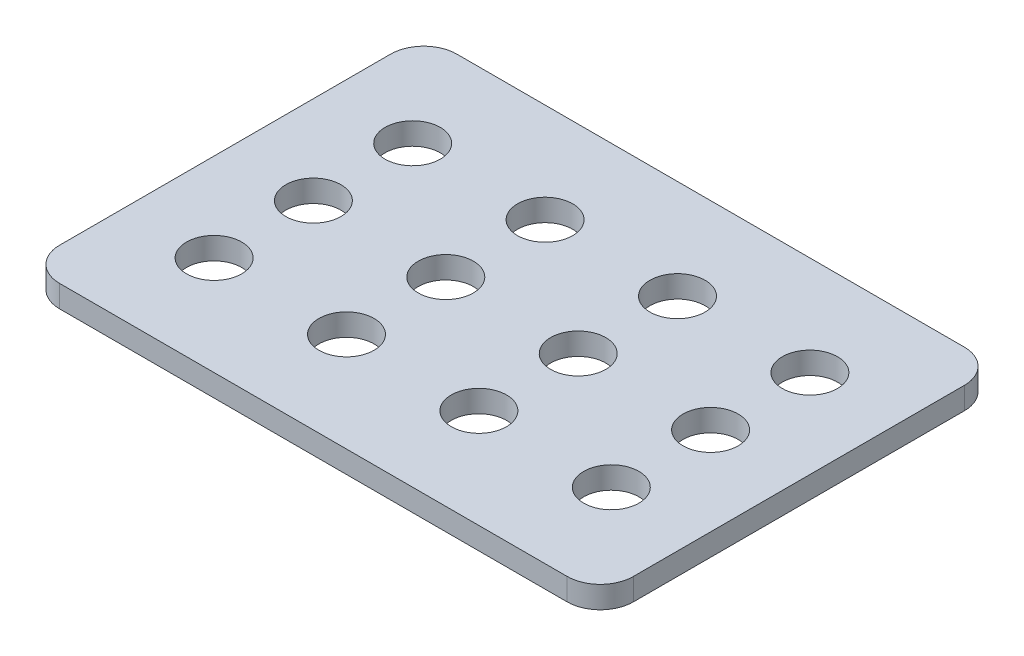
ISO-10303-21;
HEADER;
FILE_DESCRIPTION(('STEP AP214'),'2;1');
FILE_NAME('part.step','',(''),(''),'','','');
FILE_SCHEMA(('AUTOMOTIVE_DESIGN { 1 0 10303 214 1 1 1 1 }'));
ENDSEC;
DATA;
#1=APPLICATION_CONTEXT('core data for automotive mechanical design processes');
#2=APPLICATION_PROTOCOL_DEFINITION('international standard','automotive_design',2000,#1);
#3=PRODUCT_CONTEXT('',#1,'mechanical');
#4=PRODUCT('Part','Part','',(#3));
#5=PRODUCT_RELATED_PRODUCT_CATEGORY('part','',(#4));
#6=PRODUCT_DEFINITION_FORMATION('','',#4);
#7=PRODUCT_DEFINITION_CONTEXT('part definition',#1,'design');
#8=PRODUCT_DEFINITION('design','',#6,#7);
#9=PRODUCT_DEFINITION_SHAPE('','',#8);
#10=(LENGTH_UNIT() NAMED_UNIT(*) SI_UNIT(.MILLI.,.METRE.));
#11=(NAMED_UNIT(*) PLANE_ANGLE_UNIT() SI_UNIT($,.RADIAN.));
#12=(NAMED_UNIT(*) SI_UNIT($,.STERADIAN.) SOLID_ANGLE_UNIT());
#13=UNCERTAINTY_MEASURE_WITH_UNIT(LENGTH_MEASURE(1.E-05),#10,'distance_accuracy_value','');
#14=(GEOMETRIC_REPRESENTATION_CONTEXT(3) GLOBAL_UNCERTAINTY_ASSIGNED_CONTEXT((#13)) GLOBAL_UNIT_ASSIGNED_CONTEXT((#10,
#11,#12)) REPRESENTATION_CONTEXT('',''));
#15=CARTESIAN_POINT('',(0.,0.,0.));
#16=DIRECTION('',(0.,0.,1.));
#17=DIRECTION('',(1.,0.,0.));
#18=AXIS2_PLACEMENT_3D('',#15,#16,#17);
#19=CARTESIAN_POINT('',(115.,10.,-75.));
#20=DIRECTION('',(0.,-1.,0.));
#21=DIRECTION('',(0.,0.,-1.));
#22=AXIS2_PLACEMENT_3D('',#19,#20,#21);
#23=PLANE('',#22);
#24=CARTESIAN_POINT('',(115.,10.,-75.));
#25=DIRECTION('',(0.,1.,0.));
#26=DIRECTION('',(0.,0.,-1.));
#27=AXIS2_PLACEMENT_3D('',#24,#25,#26);
#28=CIRCLE('',#27,15.);
#29=CARTESIAN_POINT('',(130.,10.,-74.9999999999999));
#30=VERTEX_POINT('',#29);
#31=CARTESIAN_POINT('',(115.,10.,-90.));
#32=VERTEX_POINT('',#31);
#33=EDGE_CURVE('E168',#30,#32,#28,.T.);
#34=ORIENTED_EDGE('',*,*,#33,.T.);
#35=DIRECTION('',(-1.,0.,0.));
#36=VECTOR('',#35,1.);
#37=CARTESIAN_POINT('',(-115.,10.,-90.));
#38=LINE('',#37,#36);
#39=CARTESIAN_POINT('',(-115.,10.,-90.));
#40=VERTEX_POINT('',#39);
#41=EDGE_CURVE('E104',#32,#40,#38,.T.);
#42=ORIENTED_EDGE('',*,*,#41,.T.);
#43=CARTESIAN_POINT('',(-115.,10.,-75.));
#44=DIRECTION('',(0.,1.,0.));
#45=DIRECTION('',(0.,0.,1.));
#46=AXIS2_PLACEMENT_3D('',#43,#44,#45);
#47=CIRCLE('',#46,15.);
#48=CARTESIAN_POINT('',(-130.,10.,-74.9999999999999));
#49=VERTEX_POINT('',#48);
#50=EDGE_CURVE('E189',#40,#49,#47,.T.);
#51=ORIENTED_EDGE('',*,*,#50,.T.);
#52=DIRECTION('',(0.,0.,1.));
#53=VECTOR('',#52,1.);
#54=CARTESIAN_POINT('',(-130.,10.,-74.9999999999999));
#55=LINE('',#54,#53);
#56=CARTESIAN_POINT('',(-130.,10.,74.9999999999998));
#57=VERTEX_POINT('',#56);
#58=EDGE_CURVE('E203',#49,#57,#55,.T.);
#59=ORIENTED_EDGE('',*,*,#58,.T.);
#60=CARTESIAN_POINT('',(-115.,10.,75.));
#61=DIRECTION('',(0.,1.,0.));
#62=DIRECTION('',(0.,0.,1.));
#63=AXIS2_PLACEMENT_3D('',#60,#61,#62);
#64=CIRCLE('',#63,15.);
#65=CARTESIAN_POINT('',(-115.,10.,90.));
#66=VERTEX_POINT('',#65);
#67=EDGE_CURVE('E123',#57,#66,#64,.T.);
#68=ORIENTED_EDGE('',*,*,#67,.T.);
#69=DIRECTION('',(1.,0.,0.));
#70=VECTOR('',#69,1.);
#71=CARTESIAN_POINT('',(-115.,10.,90.));
#72=LINE('',#71,#70);
#73=CARTESIAN_POINT('',(115.,10.,90.));
#74=VERTEX_POINT('',#73);
#75=EDGE_CURVE('E117',#66,#74,#72,.T.);
#76=ORIENTED_EDGE('',*,*,#75,.T.);
#77=CARTESIAN_POINT('',(115.,10.,75.));
#78=DIRECTION('',(0.,1.,0.));
#79=DIRECTION('',(0.,0.,1.));
#80=AXIS2_PLACEMENT_3D('',#77,#78,#79);
#81=CIRCLE('',#80,15.);
#82=CARTESIAN_POINT('',(130.,10.,74.9999999999998));
#83=VERTEX_POINT('',#82);
#84=EDGE_CURVE('E121',#74,#83,#81,.T.);
#85=ORIENTED_EDGE('',*,*,#84,.T.);
#86=DIRECTION('',(0.,0.,-1.));
#87=VECTOR('',#86,1.);
#88=CARTESIAN_POINT('',(130.,10.,-74.9999999999999));
#89=LINE('',#88,#87);
#90=EDGE_CURVE('E61',#83,#30,#89,.T.);
#91=ORIENTED_EDGE('',*,*,#90,.T.);
#92=EDGE_LOOP('',(#34,#42,#51,#59,#68,#76,#85,#91));
#93=FACE_BOUND('',#92,.T.);
#94=CARTESIAN_POINT('',(-90.,10.,45.));
#95=DIRECTION('',(0.,1.,0.));
#96=DIRECTION('',(0.,0.,1.));
#97=AXIS2_PLACEMENT_3D('',#94,#95,#96);
#98=CIRCLE('',#97,12.5);
#99=CARTESIAN_POINT('',(-90.,10.,57.5));
#100=VERTEX_POINT('',#99);
#101=EDGE_CURVE('E150',#100,#100,#98,.T.);
#102=ORIENTED_EDGE('',*,*,#101,.F.);
#103=EDGE_LOOP('',(#102));
#104=FACE_BOUND('',#103,.T.);
#105=CARTESIAN_POINT('',(-30.,10.,45.));
#106=DIRECTION('',(0.,1.,0.));
#107=DIRECTION('',(0.,0.,1.));
#108=AXIS2_PLACEMENT_3D('',#105,#106,#107);
#109=CIRCLE('',#108,12.5);
#110=CARTESIAN_POINT('',(-30.,10.,57.5));
#111=VERTEX_POINT('',#110);
#112=EDGE_CURVE('E217',#111,#111,#109,.T.);
#113=ORIENTED_EDGE('',*,*,#112,.F.);
#114=EDGE_LOOP('',(#113));
#115=FACE_BOUND('',#114,.T.);
#116=CARTESIAN_POINT('',(30.,10.,45.));
#117=DIRECTION('',(0.,1.,0.));
#118=DIRECTION('',(0.,0.,1.));
#119=AXIS2_PLACEMENT_3D('',#116,#117,#118);
#120=CIRCLE('',#119,12.5);
#121=CARTESIAN_POINT('',(30.,10.,57.5));
#122=VERTEX_POINT('',#121);
#123=EDGE_CURVE('E225',#122,#122,#120,.T.);
#124=ORIENTED_EDGE('',*,*,#123,.F.);
#125=EDGE_LOOP('',(#124));
#126=FACE_BOUND('',#125,.T.);
#127=CARTESIAN_POINT('',(90.,10.,45.));
#128=DIRECTION('',(0.,1.,0.));
#129=DIRECTION('',(0.,0.,1.));
#130=AXIS2_PLACEMENT_3D('',#127,#128,#129);
#131=CIRCLE('',#130,12.5);
#132=CARTESIAN_POINT('',(90.,10.,57.5));
#133=VERTEX_POINT('',#132);
#134=EDGE_CURVE('E233',#133,#133,#131,.T.);
#135=ORIENTED_EDGE('',*,*,#134,.F.);
#136=EDGE_LOOP('',(#135));
#137=FACE_BOUND('',#136,.T.);
#138=CARTESIAN_POINT('',(-30.0000000000002,10.,0.));
#139=DIRECTION('',(0.,1.,0.));
#140=DIRECTION('',(0.,0.,1.));
#141=AXIS2_PLACEMENT_3D('',#138,#139,#140);
#142=CIRCLE('',#141,12.5);
#143=CARTESIAN_POINT('',(-30.0000000000002,10.,12.5));
#144=VERTEX_POINT('',#143);
#145=EDGE_CURVE('E241',#144,#144,#142,.T.);
#146=ORIENTED_EDGE('',*,*,#145,.F.);
#147=EDGE_LOOP('',(#146));
#148=FACE_BOUND('',#147,.T.);
#149=CARTESIAN_POINT('',(29.9999999999998,10.,0.));
#150=DIRECTION('',(0.,1.,0.));
#151=DIRECTION('',(0.,0.,1.));
#152=AXIS2_PLACEMENT_3D('',#149,#150,#151);
#153=CIRCLE('',#152,12.5);
#154=CARTESIAN_POINT('',(29.9999999999998,10.,12.5));
#155=VERTEX_POINT('',#154);
#156=EDGE_CURVE('E249',#155,#155,#153,.T.);
#157=ORIENTED_EDGE('',*,*,#156,.F.);
#158=EDGE_LOOP('',(#157));
#159=FACE_BOUND('',#158,.T.);
#160=CARTESIAN_POINT('',(89.9999999999998,10.,0.));
#161=DIRECTION('',(0.,1.,0.));
#162=DIRECTION('',(0.,0.,1.));
#163=AXIS2_PLACEMENT_3D('',#160,#161,#162);
#164=CIRCLE('',#163,12.5);
#165=CARTESIAN_POINT('',(89.9999999999998,10.,12.5));
#166=VERTEX_POINT('',#165);
#167=EDGE_CURVE('E257',#166,#166,#164,.T.);
#168=ORIENTED_EDGE('',*,*,#167,.F.);
#169=EDGE_LOOP('',(#168));
#170=FACE_BOUND('',#169,.T.);
#171=CARTESIAN_POINT('',(-30.0000000000003,10.,-45.));
#172=DIRECTION('',(0.,1.,0.));
#173=DIRECTION('',(0.,0.,1.));
#174=AXIS2_PLACEMENT_3D('',#171,#172,#173);
#175=CIRCLE('',#174,12.5);
#176=CARTESIAN_POINT('',(-30.0000000000003,10.,-32.5));
#177=VERTEX_POINT('',#176);
#178=EDGE_CURVE('E265',#177,#177,#175,.T.);
#179=ORIENTED_EDGE('',*,*,#178,.F.);
#180=EDGE_LOOP('',(#179));
#181=FACE_BOUND('',#180,.T.);
#182=CARTESIAN_POINT('',(29.9999999999997,10.,-45.));
#183=DIRECTION('',(0.,1.,0.));
#184=DIRECTION('',(0.,0.,1.));
#185=AXIS2_PLACEMENT_3D('',#182,#183,#184);
#186=CIRCLE('',#185,12.5);
#187=CARTESIAN_POINT('',(29.9999999999997,10.,-32.5));
#188=VERTEX_POINT('',#187);
#189=EDGE_CURVE('E273',#188,#188,#186,.T.);
#190=ORIENTED_EDGE('',*,*,#189,.F.);
#191=EDGE_LOOP('',(#190));
#192=FACE_BOUND('',#191,.T.);
#193=CARTESIAN_POINT('',(89.9999999999996,10.,-45.));
#194=DIRECTION('',(0.,1.,0.));
#195=DIRECTION('',(0.,0.,1.));
#196=AXIS2_PLACEMENT_3D('',#193,#194,#195);
#197=CIRCLE('',#196,12.5);
#198=CARTESIAN_POINT('',(89.9999999999996,10.,-32.5));
#199=VERTEX_POINT('',#198);
#200=EDGE_CURVE('E281',#199,#199,#197,.T.);
#201=ORIENTED_EDGE('',*,*,#200,.F.);
#202=EDGE_LOOP('',(#201));
#203=FACE_BOUND('',#202,.T.);
#204=CARTESIAN_POINT('',(-90.0000000000002,10.,0.));
#205=DIRECTION('',(0.,1.,0.));
#206=DIRECTION('',(0.,0.,1.));
#207=AXIS2_PLACEMENT_3D('',#204,#205,#206);
#208=CIRCLE('',#207,12.5);
#209=CARTESIAN_POINT('',(-90.0000000000002,10.,12.5));
#210=VERTEX_POINT('',#209);
#211=EDGE_CURVE('E289',#210,#210,#208,.T.);
#212=ORIENTED_EDGE('',*,*,#211,.F.);
#213=EDGE_LOOP('',(#212));
#214=FACE_BOUND('',#213,.T.);
#215=CARTESIAN_POINT('',(-90.0000000000003,10.,-45.));
#216=DIRECTION('',(0.,1.,0.));
#217=DIRECTION('',(0.,0.,1.));
#218=AXIS2_PLACEMENT_3D('',#215,#216,#217);
#219=CIRCLE('',#218,12.5);
#220=CARTESIAN_POINT('',(-90.0000000000003,10.,-32.5));
#221=VERTEX_POINT('',#220);
#222=EDGE_CURVE('E297',#221,#221,#219,.T.);
#223=ORIENTED_EDGE('',*,*,#222,.F.);
#224=EDGE_LOOP('',(#223));
#225=FACE_BOUND('',#224,.T.);
#226=ADVANCED_FACE('F43',(#93,#104,#115,#126,#137,#148,#159,#170,#181,#192,#203,#214,#225),#23,.F.);
#227=CARTESIAN_POINT('',(115.,0.,-75.));
#228=DIRECTION('',(0.,-1.,0.));
#229=DIRECTION('',(0.,0.,-1.));
#230=AXIS2_PLACEMENT_3D('',#227,#228,#229);
#231=PLANE('',#230);
#232=CARTESIAN_POINT('',(-90.0000000000002,0.,0.));
#233=DIRECTION('',(0.,1.,0.));
#234=DIRECTION('',(0.,0.,1.));
#235=AXIS2_PLACEMENT_3D('',#232,#233,#234);
#236=CIRCLE('',#235,12.5);
#237=CARTESIAN_POINT('',(-90.0000000000002,0.,12.5));
#238=VERTEX_POINT('',#237);
#239=EDGE_CURVE('E293',#238,#238,#236,.T.);
#240=ORIENTED_EDGE('',*,*,#239,.T.);
#241=EDGE_LOOP('',(#240));
#242=FACE_BOUND('',#241,.T.);
#243=CARTESIAN_POINT('',(29.9999999999997,0.,-45.));
#244=DIRECTION('',(0.,1.,0.));
#245=DIRECTION('',(0.,0.,1.));
#246=AXIS2_PLACEMENT_3D('',#243,#244,#245);
#247=CIRCLE('',#246,12.5);
#248=CARTESIAN_POINT('',(29.9999999999997,0.,-32.5));
#249=VERTEX_POINT('',#248);
#250=EDGE_CURVE('E277',#249,#249,#247,.T.);
#251=ORIENTED_EDGE('',*,*,#250,.T.);
#252=EDGE_LOOP('',(#251));
#253=FACE_BOUND('',#252,.T.);
#254=CARTESIAN_POINT('',(89.9999999999998,0.,0.));
#255=DIRECTION('',(0.,1.,0.));
#256=DIRECTION('',(0.,0.,1.));
#257=AXIS2_PLACEMENT_3D('',#254,#255,#256);
#258=CIRCLE('',#257,12.5);
#259=CARTESIAN_POINT('',(89.9999999999998,0.,12.5));
#260=VERTEX_POINT('',#259);
#261=EDGE_CURVE('E261',#260,#260,#258,.T.);
#262=ORIENTED_EDGE('',*,*,#261,.T.);
#263=EDGE_LOOP('',(#262));
#264=FACE_BOUND('',#263,.T.);
#265=CARTESIAN_POINT('',(-30.0000000000002,0.,0.));
#266=DIRECTION('',(0.,1.,0.));
#267=DIRECTION('',(0.,0.,1.));
#268=AXIS2_PLACEMENT_3D('',#265,#266,#267);
#269=CIRCLE('',#268,12.5);
#270=CARTESIAN_POINT('',(-30.0000000000002,0.,12.5));
#271=VERTEX_POINT('',#270);
#272=EDGE_CURVE('E245',#271,#271,#269,.T.);
#273=ORIENTED_EDGE('',*,*,#272,.T.);
#274=EDGE_LOOP('',(#273));
#275=FACE_BOUND('',#274,.T.);
#276=CARTESIAN_POINT('',(30.,0.,45.));
#277=DIRECTION('',(0.,1.,0.));
#278=DIRECTION('',(0.,0.,1.));
#279=AXIS2_PLACEMENT_3D('',#276,#277,#278);
#280=CIRCLE('',#279,12.5);
#281=CARTESIAN_POINT('',(30.,0.,57.5));
#282=VERTEX_POINT('',#281);
#283=EDGE_CURVE('E229',#282,#282,#280,.T.);
#284=ORIENTED_EDGE('',*,*,#283,.T.);
#285=EDGE_LOOP('',(#284));
#286=FACE_BOUND('',#285,.T.);
#287=CARTESIAN_POINT('',(-90.,0.,45.));
#288=DIRECTION('',(0.,1.,0.));
#289=DIRECTION('',(0.,0.,1.));
#290=AXIS2_PLACEMENT_3D('',#287,#288,#289);
#291=CIRCLE('',#290,12.5);
#292=CARTESIAN_POINT('',(-90.,0.,57.5));
#293=VERTEX_POINT('',#292);
#294=EDGE_CURVE('E213',#293,#293,#291,.T.);
#295=ORIENTED_EDGE('',*,*,#294,.T.);
#296=EDGE_LOOP('',(#295));
#297=FACE_BOUND('',#296,.T.);
#298=CARTESIAN_POINT('',(115.,0.,-75.));
#299=DIRECTION('',(0.,1.,0.));
#300=DIRECTION('',(0.,0.,-1.));
#301=AXIS2_PLACEMENT_3D('',#298,#299,#300);
#302=CIRCLE('',#301,15.);
#303=CARTESIAN_POINT('',(130.,0.,-74.9999999999999));
#304=VERTEX_POINT('',#303);
#305=CARTESIAN_POINT('',(115.,0.,-90.));
#306=VERTEX_POINT('',#305);
#307=EDGE_CURVE('E145',#304,#306,#302,.T.);
#308=ORIENTED_EDGE('',*,*,#307,.F.);
#309=DIRECTION('',(0.,0.,-1.));
#310=VECTOR('',#309,1.);
#311=CARTESIAN_POINT('',(130.,0.,-74.9999999999999));
#312=LINE('',#311,#310);
#313=CARTESIAN_POINT('',(130.,0.,74.9999999999998));
#314=VERTEX_POINT('',#313);
#315=EDGE_CURVE('E96',#314,#304,#312,.T.);
#316=ORIENTED_EDGE('',*,*,#315,.F.);
#317=CARTESIAN_POINT('',(115.,0.,75.));
#318=DIRECTION('',(0.,1.,0.));
#319=DIRECTION('',(0.,0.,1.));
#320=AXIS2_PLACEMENT_3D('',#317,#318,#319);
#321=CIRCLE('',#320,15.);
#322=CARTESIAN_POINT('',(115.,0.,90.));
#323=VERTEX_POINT('',#322);
#324=EDGE_CURVE('E90',#323,#314,#321,.T.);
#325=ORIENTED_EDGE('',*,*,#324,.F.);
#326=DIRECTION('',(1.,0.,0.));
#327=VECTOR('',#326,1.);
#328=CARTESIAN_POINT('',(-115.,0.,90.));
#329=LINE('',#328,#327);
#330=CARTESIAN_POINT('',(-115.,0.,90.));
#331=VERTEX_POINT('',#330);
#332=EDGE_CURVE('E132',#331,#323,#329,.T.);
#333=ORIENTED_EDGE('',*,*,#332,.F.);
#334=CARTESIAN_POINT('',(-115.,0.,75.));
#335=DIRECTION('',(0.,1.,0.));
#336=DIRECTION('',(0.,0.,1.));
#337=AXIS2_PLACEMENT_3D('',#334,#335,#336);
#338=CIRCLE('',#337,15.);
#339=CARTESIAN_POINT('',(-130.,0.,74.9999999999998));
#340=VERTEX_POINT('',#339);
#341=EDGE_CURVE('E159',#340,#331,#338,.T.);
#342=ORIENTED_EDGE('',*,*,#341,.F.);
#343=DIRECTION('',(0.,0.,1.));
#344=VECTOR('',#343,1.);
#345=CARTESIAN_POINT('',(-130.,0.,-74.9999999999999));
#346=LINE('',#345,#344);
#347=CARTESIAN_POINT('',(-130.,0.,-74.9999999999999));
#348=VERTEX_POINT('',#347);
#349=EDGE_CURVE('E156',#348,#340,#346,.T.);
#350=ORIENTED_EDGE('',*,*,#349,.F.);
#351=CARTESIAN_POINT('',(-115.,0.,-75.));
#352=DIRECTION('',(0.,1.,0.));
#353=DIRECTION('',(0.,0.,1.));
#354=AXIS2_PLACEMENT_3D('',#351,#352,#353);
#355=CIRCLE('',#354,15.);
#356=CARTESIAN_POINT('',(-115.,0.,-90.));
#357=VERTEX_POINT('',#356);
#358=EDGE_CURVE('E153',#357,#348,#355,.T.);
#359=ORIENTED_EDGE('',*,*,#358,.F.);
#360=DIRECTION('',(-1.,0.,0.));
#361=VECTOR('',#360,1.);
#362=CARTESIAN_POINT('',(-115.,0.,-90.));
#363=LINE('',#362,#361);
#364=EDGE_CURVE('E149',#306,#357,#363,.T.);
#365=ORIENTED_EDGE('',*,*,#364,.F.);
#366=EDGE_LOOP('',(#308,#316,#325,#333,#342,#350,#359,#365));
#367=FACE_BOUND('',#366,.T.);
#368=CARTESIAN_POINT('',(-30.,0.,45.));
#369=DIRECTION('',(0.,1.,0.));
#370=DIRECTION('',(0.,0.,1.));
#371=AXIS2_PLACEMENT_3D('',#368,#369,#370);
#372=CIRCLE('',#371,12.5);
#373=CARTESIAN_POINT('',(-30.,0.,57.5));
#374=VERTEX_POINT('',#373);
#375=EDGE_CURVE('E221',#374,#374,#372,.T.);
#376=ORIENTED_EDGE('',*,*,#375,.T.);
#377=EDGE_LOOP('',(#376));
#378=FACE_BOUND('',#377,.T.);
#379=CARTESIAN_POINT('',(90.,0.,45.));
#380=DIRECTION('',(0.,1.,0.));
#381=DIRECTION('',(0.,0.,1.));
#382=AXIS2_PLACEMENT_3D('',#379,#380,#381);
#383=CIRCLE('',#382,12.5);
#384=CARTESIAN_POINT('',(90.,0.,57.5));
#385=VERTEX_POINT('',#384);
#386=EDGE_CURVE('E237',#385,#385,#383,.T.);
#387=ORIENTED_EDGE('',*,*,#386,.T.);
#388=EDGE_LOOP('',(#387));
#389=FACE_BOUND('',#388,.T.);
#390=CARTESIAN_POINT('',(29.9999999999998,0.,0.));
#391=DIRECTION('',(0.,1.,0.));
#392=DIRECTION('',(0.,0.,1.));
#393=AXIS2_PLACEMENT_3D('',#390,#391,#392);
#394=CIRCLE('',#393,12.5);
#395=CARTESIAN_POINT('',(29.9999999999998,0.,12.5));
#396=VERTEX_POINT('',#395);
#397=EDGE_CURVE('E253',#396,#396,#394,.T.);
#398=ORIENTED_EDGE('',*,*,#397,.T.);
#399=EDGE_LOOP('',(#398));
#400=FACE_BOUND('',#399,.T.);
#401=CARTESIAN_POINT('',(-30.0000000000003,0.,-45.));
#402=DIRECTION('',(0.,1.,0.));
#403=DIRECTION('',(0.,0.,1.));
#404=AXIS2_PLACEMENT_3D('',#401,#402,#403);
#405=CIRCLE('',#404,12.5);
#406=CARTESIAN_POINT('',(-30.0000000000003,0.,-32.5));
#407=VERTEX_POINT('',#406);
#408=EDGE_CURVE('E269',#407,#407,#405,.T.);
#409=ORIENTED_EDGE('',*,*,#408,.T.);
#410=EDGE_LOOP('',(#409));
#411=FACE_BOUND('',#410,.T.);
#412=CARTESIAN_POINT('',(89.9999999999996,0.,-45.));
#413=DIRECTION('',(0.,1.,0.));
#414=DIRECTION('',(0.,0.,1.));
#415=AXIS2_PLACEMENT_3D('',#412,#413,#414);
#416=CIRCLE('',#415,12.5);
#417=CARTESIAN_POINT('',(89.9999999999996,0.,-32.5));
#418=VERTEX_POINT('',#417);
#419=EDGE_CURVE('E285',#418,#418,#416,.T.);
#420=ORIENTED_EDGE('',*,*,#419,.T.);
#421=EDGE_LOOP('',(#420));
#422=FACE_BOUND('',#421,.T.);
#423=CARTESIAN_POINT('',(-90.0000000000003,0.,-45.));
#424=DIRECTION('',(0.,1.,0.));
#425=DIRECTION('',(0.,0.,1.));
#426=AXIS2_PLACEMENT_3D('',#423,#424,#425);
#427=CIRCLE('',#426,12.5);
#428=CARTESIAN_POINT('',(-90.0000000000003,0.,-32.5));
#429=VERTEX_POINT('',#428);
#430=EDGE_CURVE('E301',#429,#429,#427,.T.);
#431=ORIENTED_EDGE('',*,*,#430,.T.);
#432=EDGE_LOOP('',(#431));
#433=FACE_BOUND('',#432,.T.);
#434=ADVANCED_FACE('F193',(#242,#253,#264,#275,#286,#297,#367,#378,#389,#400,#411,#422,#433),
#231,.T.);
#435=CARTESIAN_POINT('',(115.,10.,-75.));
#436=DIRECTION('',(0.,-1.,0.));
#437=DIRECTION('',(0.,0.,-1.));
#438=AXIS2_PLACEMENT_3D('',#435,#436,#437);
#439=CYLINDRICAL_SURFACE('',#438,15.);
#440=ORIENTED_EDGE('',*,*,#307,.T.);
#441=DIRECTION('',(0.,-1.,0.));
#442=VECTOR('',#441,1.);
#443=CARTESIAN_POINT('',(115.,10.,-90.));
#444=LINE('',#443,#442);
#445=EDGE_CURVE('E11',#32,#306,#444,.T.);
#446=ORIENTED_EDGE('',*,*,#445,.F.);
#447=ORIENTED_EDGE('',*,*,#33,.F.);
#448=DIRECTION('',(0.,-1.,0.));
#449=VECTOR('',#448,1.);
#450=CARTESIAN_POINT('',(130.,10.,-74.9999999999999));
#451=LINE('',#450,#449);
#452=EDGE_CURVE('E141',#30,#304,#451,.T.);
#453=ORIENTED_EDGE('',*,*,#452,.T.);
#454=EDGE_LOOP('',(#440,#446,#447,#453));
#455=FACE_BOUND('',#454,.T.);
#456=ADVANCED_FACE('F45',(#455),#439,.T.);
#457=CARTESIAN_POINT('',(-115.,10.,-90.));
#458=DIRECTION('',(0.,0.,1.));
#459=DIRECTION('',(1.,0.,0.));
#460=AXIS2_PLACEMENT_3D('',#457,#458,#459);
#461=PLANE('',#460);
#462=ORIENTED_EDGE('',*,*,#364,.T.);
#463=DIRECTION('',(0.,-1.,0.));
#464=VECTOR('',#463,1.);
#465=CARTESIAN_POINT('',(-115.,10.,-90.));
#466=LINE('',#465,#464);
#467=EDGE_CURVE('E53',#40,#357,#466,.T.);
#468=ORIENTED_EDGE('',*,*,#467,.F.);
#469=ORIENTED_EDGE('',*,*,#41,.F.);
#470=ORIENTED_EDGE('',*,*,#445,.T.);
#471=EDGE_LOOP('',(#462,#468,#469,#470));
#472=FACE_BOUND('',#471,.T.);
#473=ADVANCED_FACE('F335',(#472),#461,.F.);
#474=CARTESIAN_POINT('',(-115.,10.,-75.));
#475=DIRECTION('',(0.,-1.,0.));
#476=DIRECTION('',(0.,0.,-1.));
#477=AXIS2_PLACEMENT_3D('',#474,#475,#476);
#478=CYLINDRICAL_SURFACE('',#477,15.);
#479=ORIENTED_EDGE('',*,*,#358,.T.);
#480=DIRECTION('',(0.,-1.,0.));
#481=VECTOR('',#480,1.);
#482=CARTESIAN_POINT('',(-130.,10.,-74.9999999999999));
#483=LINE('',#482,#481);
#484=EDGE_CURVE('E179',#49,#348,#483,.T.);
#485=ORIENTED_EDGE('',*,*,#484,.F.);
#486=ORIENTED_EDGE('',*,*,#50,.F.);
#487=ORIENTED_EDGE('',*,*,#467,.T.);
#488=EDGE_LOOP('',(#479,#485,#486,#487));
#489=FACE_BOUND('',#488,.T.);
#490=ADVANCED_FACE('F187',(#489),#478,.T.);
#491=CARTESIAN_POINT('',(-130.,10.,-74.9999999999999));
#492=DIRECTION('',(1.,0.,0.));
#493=DIRECTION('',(0.,0.,-1.));
#494=AXIS2_PLACEMENT_3D('',#491,#492,#493);
#495=PLANE('',#494);
#496=ORIENTED_EDGE('',*,*,#349,.T.);
#497=DIRECTION('',(0.,-1.,0.));
#498=VECTOR('',#497,1.);
#499=CARTESIAN_POINT('',(-130.,10.,74.9999999999998));
#500=LINE('',#499,#498);
#501=EDGE_CURVE('E175',#57,#340,#500,.T.);
#502=ORIENTED_EDGE('',*,*,#501,.F.);
#503=ORIENTED_EDGE('',*,*,#58,.F.);
#504=ORIENTED_EDGE('',*,*,#484,.T.);
#505=EDGE_LOOP('',(#496,#502,#503,#504));
#506=FACE_BOUND('',#505,.T.);
#507=ADVANCED_FACE('F198',(#506),#495,.F.);
#508=CARTESIAN_POINT('',(-115.,10.,75.));
#509=DIRECTION('',(0.,-1.,0.));
#510=DIRECTION('',(0.,0.,-1.));
#511=AXIS2_PLACEMENT_3D('',#508,#509,#510);
#512=CYLINDRICAL_SURFACE('',#511,15.);
#513=ORIENTED_EDGE('',*,*,#341,.T.);
#514=DIRECTION('',(0.,-1.,0.));
#515=VECTOR('',#514,1.);
#516=CARTESIAN_POINT('',(-115.,10.,90.));
#517=LINE('',#516,#515);
#518=EDGE_CURVE('E134',#66,#331,#517,.T.);
#519=ORIENTED_EDGE('',*,*,#518,.F.);
#520=ORIENTED_EDGE('',*,*,#67,.F.);
#521=ORIENTED_EDGE('',*,*,#501,.T.);
#522=EDGE_LOOP('',(#513,#519,#520,#521));
#523=FACE_BOUND('',#522,.T.);
#524=ADVANCED_FACE('F201',(#523),#512,.T.);
#525=CARTESIAN_POINT('',(-115.,10.,90.));
#526=DIRECTION('',(0.,0.,-1.));
#527=DIRECTION('',(-1.,0.,0.));
#528=AXIS2_PLACEMENT_3D('',#525,#526,#527);
#529=PLANE('',#528);
#530=ORIENTED_EDGE('',*,*,#332,.T.);
#531=DIRECTION('',(0.,-1.,0.));
#532=VECTOR('',#531,1.);
#533=CARTESIAN_POINT('',(115.,10.,90.));
#534=LINE('',#533,#532);
#535=EDGE_CURVE('E129',#74,#323,#534,.T.);
#536=ORIENTED_EDGE('',*,*,#535,.F.);
#537=ORIENTED_EDGE('',*,*,#75,.F.);
#538=ORIENTED_EDGE('',*,*,#518,.T.);
#539=EDGE_LOOP('',(#530,#536,#537,#538));
#540=FACE_BOUND('',#539,.T.);
#541=ADVANCED_FACE('F130',(#540),#529,.F.);
#542=CARTESIAN_POINT('',(115.,10.,75.));
#543=DIRECTION('',(0.,-1.,0.));
#544=DIRECTION('',(0.,0.,-1.));
#545=AXIS2_PLACEMENT_3D('',#542,#543,#544);
#546=CYLINDRICAL_SURFACE('',#545,15.);
#547=ORIENTED_EDGE('',*,*,#324,.T.);
#548=DIRECTION('',(0.,-1.,0.));
#549=VECTOR('',#548,1.);
#550=CARTESIAN_POINT('',(130.,10.,74.9999999999998));
#551=LINE('',#550,#549);
#552=EDGE_CURVE('E135',#83,#314,#551,.T.);
#553=ORIENTED_EDGE('',*,*,#552,.F.);
#554=ORIENTED_EDGE('',*,*,#84,.F.);
#555=ORIENTED_EDGE('',*,*,#535,.T.);
#556=EDGE_LOOP('',(#547,#553,#554,#555));
#557=FACE_BOUND('',#556,.T.);
#558=ADVANCED_FACE('F137',(#557),#546,.T.);
#559=CARTESIAN_POINT('',(130.,10.,-74.9999999999999));
#560=DIRECTION('',(-1.,0.,0.));
#561=DIRECTION('',(0.,0.,1.));
#562=AXIS2_PLACEMENT_3D('',#559,#560,#561);
#563=PLANE('',#562);
#564=ORIENTED_EDGE('',*,*,#315,.T.);
#565=ORIENTED_EDGE('',*,*,#452,.F.);
#566=ORIENTED_EDGE('',*,*,#90,.F.);
#567=ORIENTED_EDGE('',*,*,#552,.T.);
#568=EDGE_LOOP('',(#564,#565,#566,#567));
#569=FACE_BOUND('',#568,.T.);
#570=ADVANCED_FACE('F323',(#569),#563,.F.);
#571=CARTESIAN_POINT('',(-90.,10.,45.));
#572=DIRECTION('',(0.,-1.,0.));
#573=DIRECTION('',(0.,0.,-1.));
#574=AXIS2_PLACEMENT_3D('',#571,#572,#573);
#575=CYLINDRICAL_SURFACE('',#574,12.5);
#576=ORIENTED_EDGE('',*,*,#101,.T.);
#577=EDGE_LOOP('',(#576));
#578=FACE_BOUND('',#577,.T.);
#579=ORIENTED_EDGE('',*,*,#294,.F.);
#580=EDGE_LOOP('',(#579));
#581=FACE_BOUND('',#580,.T.);
#582=ADVANCED_FACE('F320',(#578,#581),#575,.F.);
#583=CARTESIAN_POINT('',(-30.,10.,45.));
#584=DIRECTION('',(0.,-1.,0.));
#585=DIRECTION('',(0.,0.,-1.));
#586=AXIS2_PLACEMENT_3D('',#583,#584,#585);
#587=CYLINDRICAL_SURFACE('',#586,12.5);
#588=ORIENTED_EDGE('',*,*,#112,.T.);
#589=EDGE_LOOP('',(#588));
#590=FACE_BOUND('',#589,.T.);
#591=ORIENTED_EDGE('',*,*,#375,.F.);
#592=EDGE_LOOP('',(#591));
#593=FACE_BOUND('',#592,.T.);
#594=ADVANCED_FACE('F411',(#590,#593),#587,.F.);
#595=CARTESIAN_POINT('',(30.,10.,45.));
#596=DIRECTION('',(0.,-1.,0.));
#597=DIRECTION('',(0.,0.,-1.));
#598=AXIS2_PLACEMENT_3D('',#595,#596,#597);
#599=CYLINDRICAL_SURFACE('',#598,12.5);
#600=ORIENTED_EDGE('',*,*,#123,.T.);
#601=EDGE_LOOP('',(#600));
#602=FACE_BOUND('',#601,.T.);
#603=ORIENTED_EDGE('',*,*,#283,.F.);
#604=EDGE_LOOP('',(#603));
#605=FACE_BOUND('',#604,.T.);
#606=ADVANCED_FACE('F420',(#602,#605),#599,.F.);
#607=CARTESIAN_POINT('',(90.,10.,45.));
#608=DIRECTION('',(0.,-1.,0.));
#609=DIRECTION('',(0.,0.,-1.));
#610=AXIS2_PLACEMENT_3D('',#607,#608,#609);
#611=CYLINDRICAL_SURFACE('',#610,12.5);
#612=ORIENTED_EDGE('',*,*,#134,.T.);
#613=EDGE_LOOP('',(#612));
#614=FACE_BOUND('',#613,.T.);
#615=ORIENTED_EDGE('',*,*,#386,.F.);
#616=EDGE_LOOP('',(#615));
#617=FACE_BOUND('',#616,.T.);
#618=ADVANCED_FACE('F429',(#614,#617),#611,.F.);
#619=CARTESIAN_POINT('',(-30.0000000000002,10.,0.));
#620=DIRECTION('',(0.,-1.,0.));
#621=DIRECTION('',(0.,0.,-1.));
#622=AXIS2_PLACEMENT_3D('',#619,#620,#621);
#623=CYLINDRICAL_SURFACE('',#622,12.5);
#624=ORIENTED_EDGE('',*,*,#145,.T.);
#625=EDGE_LOOP('',(#624));
#626=FACE_BOUND('',#625,.T.);
#627=ORIENTED_EDGE('',*,*,#272,.F.);
#628=EDGE_LOOP('',(#627));
#629=FACE_BOUND('',#628,.T.);
#630=ADVANCED_FACE('F439',(#626,#629),#623,.F.);
#631=CARTESIAN_POINT('',(29.9999999999998,10.,0.));
#632=DIRECTION('',(0.,-1.,0.));
#633=DIRECTION('',(0.,0.,-1.));
#634=AXIS2_PLACEMENT_3D('',#631,#632,#633);
#635=CYLINDRICAL_SURFACE('',#634,12.5);
#636=ORIENTED_EDGE('',*,*,#156,.T.);
#637=EDGE_LOOP('',(#636));
#638=FACE_BOUND('',#637,.T.);
#639=ORIENTED_EDGE('',*,*,#397,.F.);
#640=EDGE_LOOP('',(#639));
#641=FACE_BOUND('',#640,.T.);
#642=ADVANCED_FACE('F449',(#638,#641),#635,.F.);
#643=CARTESIAN_POINT('',(89.9999999999998,10.,0.));
#644=DIRECTION('',(0.,-1.,0.));
#645=DIRECTION('',(0.,0.,-1.));
#646=AXIS2_PLACEMENT_3D('',#643,#644,#645);
#647=CYLINDRICAL_SURFACE('',#646,12.5);
#648=ORIENTED_EDGE('',*,*,#167,.T.);
#649=EDGE_LOOP('',(#648));
#650=FACE_BOUND('',#649,.T.);
#651=ORIENTED_EDGE('',*,*,#261,.F.);
#652=EDGE_LOOP('',(#651));
#653=FACE_BOUND('',#652,.T.);
#654=ADVANCED_FACE('F459',(#650,#653),#647,.F.);
#655=CARTESIAN_POINT('',(-30.0000000000003,10.,-45.));
#656=DIRECTION('',(0.,-1.,0.));
#657=DIRECTION('',(0.,0.,-1.));
#658=AXIS2_PLACEMENT_3D('',#655,#656,#657);
#659=CYLINDRICAL_SURFACE('',#658,12.5);
#660=ORIENTED_EDGE('',*,*,#178,.T.);
#661=EDGE_LOOP('',(#660));
#662=FACE_BOUND('',#661,.T.);
#663=ORIENTED_EDGE('',*,*,#408,.F.);
#664=EDGE_LOOP('',(#663));
#665=FACE_BOUND('',#664,.T.);
#666=ADVANCED_FACE('F469',(#662,#665),#659,.F.);
#667=CARTESIAN_POINT('',(29.9999999999997,10.,-45.));
#668=DIRECTION('',(0.,-1.,0.));
#669=DIRECTION('',(0.,0.,-1.));
#670=AXIS2_PLACEMENT_3D('',#667,#668,#669);
#671=CYLINDRICAL_SURFACE('',#670,12.5);
#672=ORIENTED_EDGE('',*,*,#189,.T.);
#673=EDGE_LOOP('',(#672));
#674=FACE_BOUND('',#673,.T.);
#675=ORIENTED_EDGE('',*,*,#250,.F.);
#676=EDGE_LOOP('',(#675));
#677=FACE_BOUND('',#676,.T.);
#678=ADVANCED_FACE('F479',(#674,#677),#671,.F.);
#679=CARTESIAN_POINT('',(89.9999999999996,10.,-45.));
#680=DIRECTION('',(0.,-1.,0.));
#681=DIRECTION('',(0.,0.,-1.));
#682=AXIS2_PLACEMENT_3D('',#679,#680,#681);
#683=CYLINDRICAL_SURFACE('',#682,12.5);
#684=ORIENTED_EDGE('',*,*,#200,.T.);
#685=EDGE_LOOP('',(#684));
#686=FACE_BOUND('',#685,.T.);
#687=ORIENTED_EDGE('',*,*,#419,.F.);
#688=EDGE_LOOP('',(#687));
#689=FACE_BOUND('',#688,.T.);
#690=ADVANCED_FACE('F489',(#686,#689),#683,.F.);
#691=CARTESIAN_POINT('',(-90.0000000000002,10.,0.));
#692=DIRECTION('',(0.,-1.,0.));
#693=DIRECTION('',(0.,0.,-1.));
#694=AXIS2_PLACEMENT_3D('',#691,#692,#693);
#695=CYLINDRICAL_SURFACE('',#694,12.5);
#696=ORIENTED_EDGE('',*,*,#211,.T.);
#697=EDGE_LOOP('',(#696));
#698=FACE_BOUND('',#697,.T.);
#699=ORIENTED_EDGE('',*,*,#239,.F.);
#700=EDGE_LOOP('',(#699));
#701=FACE_BOUND('',#700,.T.);
#702=ADVANCED_FACE('F499',(#698,#701),#695,.F.);
#703=CARTESIAN_POINT('',(-90.0000000000003,10.,-45.));
#704=DIRECTION('',(0.,-1.,0.));
#705=DIRECTION('',(0.,0.,-1.));
#706=AXIS2_PLACEMENT_3D('',#703,#704,#705);
#707=CYLINDRICAL_SURFACE('',#706,12.5);
#708=ORIENTED_EDGE('',*,*,#222,.T.);
#709=EDGE_LOOP('',(#708));
#710=FACE_BOUND('',#709,.T.);
#711=ORIENTED_EDGE('',*,*,#430,.F.);
#712=EDGE_LOOP('',(#711));
#713=FACE_BOUND('',#712,.T.);
#714=ADVANCED_FACE('F309',(#710,#713),#707,.F.);
#715=CLOSED_SHELL('',(#226,#434,#456,#473,#490,#507,#524,#541,#558,#570,#582,#594,#606,#618,
#630,#642,#654,#666,#678,#690,#702,#714));
#716=MANIFOLD_SOLID_BREP('B2',#715);
#717=ADVANCED_BREP_SHAPE_REPRESENTATION('',(#18,#716),#14);
#718=SHAPE_DEFINITION_REPRESENTATION(#9,#717);
ENDSEC;
END-ISO-10303-21;
